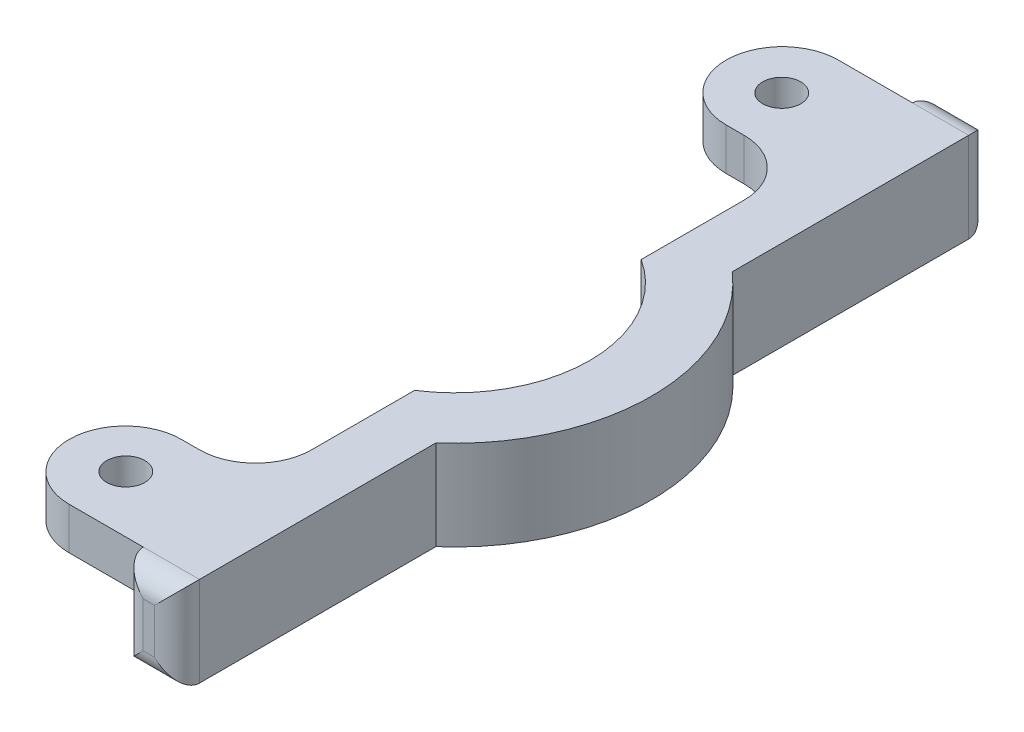
ISO-10303-21;
HEADER;
FILE_DESCRIPTION(('STEP AP214'),'2;1');
FILE_NAME('part.step','',(''),(''),'','','');
FILE_SCHEMA(('AUTOMOTIVE_DESIGN { 1 0 10303 214 1 1 1 1 }'));
ENDSEC;
DATA;
#1=APPLICATION_CONTEXT('core data for automotive mechanical design processes');
#2=APPLICATION_PROTOCOL_DEFINITION('international standard','automotive_design',2000,#1);
#3=PRODUCT_CONTEXT('',#1,'mechanical');
#4=PRODUCT('Part','Part','',(#3));
#5=PRODUCT_RELATED_PRODUCT_CATEGORY('part','',(#4));
#6=PRODUCT_DEFINITION_FORMATION('','',#4);
#7=PRODUCT_DEFINITION_CONTEXT('part definition',#1,'design');
#8=PRODUCT_DEFINITION('design','',#6,#7);
#9=PRODUCT_DEFINITION_SHAPE('','',#8);
#10=(LENGTH_UNIT() NAMED_UNIT(*) SI_UNIT(.MILLI.,.METRE.));
#11=(NAMED_UNIT(*) PLANE_ANGLE_UNIT() SI_UNIT($,.RADIAN.));
#12=(NAMED_UNIT(*) SI_UNIT($,.STERADIAN.) SOLID_ANGLE_UNIT());
#13=UNCERTAINTY_MEASURE_WITH_UNIT(LENGTH_MEASURE(1.E-05),#10,'distance_accuracy_value','');
#14=(GEOMETRIC_REPRESENTATION_CONTEXT(3) GLOBAL_UNCERTAINTY_ASSIGNED_CONTEXT((#13)) GLOBAL_UNIT_ASSIGNED_CONTEXT((#10,
#11,#12)) REPRESENTATION_CONTEXT('',''));
#15=CARTESIAN_POINT('',(0.,0.,0.));
#16=DIRECTION('',(0.,0.,1.));
#17=DIRECTION('',(1.,0.,0.));
#18=AXIS2_PLACEMENT_3D('',#15,#16,#17);
#19=CARTESIAN_POINT('',(8.255,0.,42.2389387108255));
#20=DIRECTION('',(1.,0.,0.));
#21=DIRECTION('',(0.,0.,-1.));
#22=AXIS2_PLACEMENT_3D('',#19,#20,#21);
#23=PLANE('',#22);
#24=DIRECTION('',(0.,0.,-1.));
#25=VECTOR('',#24,1.);
#26=CARTESIAN_POINT('',(8.255,5.08,42.2389387108255));
#27=LINE('',#26,#25);
#28=CARTESIAN_POINT('',(8.255,5.08,-12.8106430361633));
#29=VERTEX_POINT('',#28);
#30=CARTESIAN_POINT('',(8.255,5.08,-24.4450575477753));
#31=VERTEX_POINT('',#30);
#32=EDGE_CURVE('E283',#29,#31,#27,.T.);
#33=ORIENTED_EDGE('',*,*,#32,.T.);
#34=DIRECTION('',(0.,1.,0.));
#35=VECTOR('',#34,1.);
#36=CARTESIAN_POINT('',(8.255,0.3175,-24.4450575477753));
#37=LINE('',#36,#35);
#38=CARTESIAN_POINT('',(8.255,0.3175,-24.4450575477753));
#39=VERTEX_POINT('',#38);
#40=EDGE_CURVE('E356',#31,#39,#37,.F.);
#41=ORIENTED_EDGE('',*,*,#40,.T.);
#42=DIRECTION('',(0.,0.,1.));
#43=VECTOR('',#42,1.);
#44=CARTESIAN_POINT('',(8.255,0.3175,-43.4950575477753));
#45=LINE('',#44,#43);
#46=CARTESIAN_POINT('',(8.255,0.3175,-43.4950575477753));
#47=VERTEX_POINT('',#46);
#48=EDGE_CURVE('E248',#47,#39,#45,.T.);
#49=ORIENTED_EDGE('',*,*,#48,.F.);
#50=DIRECTION('',(0.,1.,0.));
#51=VECTOR('',#50,1.);
#52=CARTESIAN_POINT('',(8.255,-5.08,-43.4950575477753));
#53=LINE('',#52,#51);
#54=CARTESIAN_POINT('',(8.255,-5.08,-43.4950575477753));
#55=VERTEX_POINT('',#54);
#56=EDGE_CURVE('E328',#47,#55,#53,.F.);
#57=ORIENTED_EDGE('',*,*,#56,.T.);
#58=DIRECTION('',(0.,0.,-1.));
#59=VECTOR('',#58,1.);
#60=CARTESIAN_POINT('',(8.255,-5.08,0.));
#61=LINE('',#60,#59);
#62=CARTESIAN_POINT('',(8.255,-5.08,-12.8106430361633));
#63=VERTEX_POINT('',#62);
#64=EDGE_CURVE('E297',#63,#55,#61,.T.);
#65=ORIENTED_EDGE('',*,*,#64,.F.);
#66=DIRECTION('',(0.,-1.,0.));
#67=VECTOR('',#66,1.);
#68=CARTESIAN_POINT('',(8.255,5.08,-12.8106430361633));
#69=LINE('',#68,#67);
#70=EDGE_CURVE('E292',#63,#29,#69,.F.);
#71=ORIENTED_EDGE('',*,*,#70,.T.);
#72=EDGE_LOOP('',(#33,#41,#49,#57,#65,#71));
#73=FACE_BOUND('',#72,.T.);
#74=ADVANCED_FACE('F36',(#73),#23,.F.);
#75=CARTESIAN_POINT('',(0.,5.08,0.));
#76=DIRECTION('',(0.,-1.,0.));
#77=DIRECTION('',(0.,0.,-1.));
#78=AXIS2_PLACEMENT_3D('',#75,#76,#77);
#79=CYLINDRICAL_SURFACE('',#78,22.225);
#80=DIRECTION('',(0.,1.,0.));
#81=VECTOR('',#80,1.);
#82=CARTESIAN_POINT('',(14.605,0.,16.7524505670066));
#83=LINE('',#82,#81);
#84=CARTESIAN_POINT('',(14.605,-5.08,16.7524505670066));
#85=VERTEX_POINT('',#84);
#86=CARTESIAN_POINT('',(14.605,5.08,16.7524505670066));
#87=VERTEX_POINT('',#86);
#88=EDGE_CURVE('E274',#85,#87,#83,.T.);
#89=ORIENTED_EDGE('',*,*,#88,.F.);
#90=CARTESIAN_POINT('',(0.,-5.08,0.));
#91=DIRECTION('',(0.,1.,0.));
#92=DIRECTION('',(0.,0.,1.));
#93=AXIS2_PLACEMENT_3D('',#90,#91,#92);
#94=CIRCLE('',#93,22.225);
#95=CARTESIAN_POINT('',(14.605,-5.08,-16.7524505670066));
#96=VERTEX_POINT('',#95);
#97=EDGE_CURVE('E270',#85,#96,#94,.T.);
#98=ORIENTED_EDGE('',*,*,#97,.T.);
#99=DIRECTION('',(0.,1.,0.));
#100=VECTOR('',#99,1.);
#101=CARTESIAN_POINT('',(14.605,0.,-16.7524505670066));
#102=LINE('',#101,#100);
#103=CARTESIAN_POINT('',(14.605,5.08,-16.7524505670066));
#104=VERTEX_POINT('',#103);
#105=EDGE_CURVE('E280',#96,#104,#102,.T.);
#106=ORIENTED_EDGE('',*,*,#105,.T.);
#107=CARTESIAN_POINT('',(0.,5.08,0.));
#108=DIRECTION('',(0.,1.,0.));
#109=DIRECTION('',(0.,0.,1.));
#110=AXIS2_PLACEMENT_3D('',#107,#108,#109);
#111=CIRCLE('',#110,22.225);
#112=EDGE_CURVE('E290',#87,#104,#111,.T.);
#113=ORIENTED_EDGE('',*,*,#112,.F.);
#114=EDGE_LOOP('',(#89,#98,#106,#113));
#115=FACE_BOUND('',#114,.T.);
#116=ADVANCED_FACE('F426',(#115),#79,.T.);
#117=CARTESIAN_POINT('',(0.,5.08,0.));
#118=DIRECTION('',(0.,-1.,0.));
#119=DIRECTION('',(0.,0.,-1.));
#120=AXIS2_PLACEMENT_3D('',#117,#118,#119);
#121=CYLINDRICAL_SURFACE('',#120,15.24);
#122=ORIENTED_EDGE('',*,*,#70,.F.);
#123=CARTESIAN_POINT('',(0.,-5.08,0.));
#124=DIRECTION('',(0.,1.,0.));
#125=DIRECTION('',(0.,0.,1.));
#126=AXIS2_PLACEMENT_3D('',#123,#124,#125);
#127=CIRCLE('',#126,15.24);
#128=CARTESIAN_POINT('',(8.255,-5.08,12.8106430361633));
#129=VERTEX_POINT('',#128);
#130=EDGE_CURVE('E267',#129,#63,#127,.T.);
#131=ORIENTED_EDGE('',*,*,#130,.F.);
#132=DIRECTION('',(0.,-1.,0.));
#133=VECTOR('',#132,1.);
#134=CARTESIAN_POINT('',(8.255,5.08,12.8106430361633));
#135=LINE('',#134,#133);
#136=CARTESIAN_POINT('',(8.255,5.08,12.8106430361633));
#137=VERTEX_POINT('',#136);
#138=EDGE_CURVE('E294',#137,#129,#135,.T.);
#139=ORIENTED_EDGE('',*,*,#138,.F.);
#140=CARTESIAN_POINT('',(0.,5.08,0.));
#141=DIRECTION('',(0.,1.,0.));
#142=DIRECTION('',(0.,0.,1.));
#143=AXIS2_PLACEMENT_3D('',#140,#141,#142);
#144=CIRCLE('',#143,15.24);
#145=EDGE_CURVE('E287',#137,#29,#144,.T.);
#146=ORIENTED_EDGE('',*,*,#145,.T.);
#147=EDGE_LOOP('',(#122,#131,#139,#146));
#148=FACE_BOUND('',#147,.T.);
#149=ADVANCED_FACE('F433',(#148),#121,.F.);
#150=CARTESIAN_POINT('',(0.,-5.08,0.));
#151=DIRECTION('',(0.,-1.,0.));
#152=DIRECTION('',(0.,0.,1.));
#153=AXIS2_PLACEMENT_3D('',#150,#151,#152);
#154=PLANE('',#153);
#155=DIRECTION('',(0.,0.,1.));
#156=VECTOR('',#155,1.);
#157=CARTESIAN_POINT('',(14.605,-5.08,46.0350575477753));
#158=LINE('',#157,#156);
#159=CARTESIAN_POINT('',(14.605,-5.08,43.4950575477753));
#160=VERTEX_POINT('',#159);
#161=EDGE_CURVE('E261',#85,#160,#158,.T.);
#162=ORIENTED_EDGE('',*,*,#161,.T.);
#163=DIRECTION('',(-1.,0.,0.));
#164=VECTOR('',#163,1.);
#165=CARTESIAN_POINT('',(8.255,-5.08,43.4950575477753));
#166=LINE('',#165,#164);
#167=CARTESIAN_POINT('',(8.255,-5.08,43.4950575477753));
#168=VERTEX_POINT('',#167);
#169=EDGE_CURVE('E314',#160,#168,#166,.T.);
#170=ORIENTED_EDGE('',*,*,#169,.T.);
#171=EDGE_CURVE('E300',#168,#129,#61,.T.);
#172=ORIENTED_EDGE('',*,*,#171,.T.);
#173=ORIENTED_EDGE('',*,*,#130,.T.);
#174=ORIENTED_EDGE('',*,*,#64,.T.);
#175=DIRECTION('',(-1.,0.,0.));
#176=VECTOR('',#175,1.);
#177=CARTESIAN_POINT('',(0.,-5.08,-43.4950575477753));
#178=LINE('',#177,#176);
#179=CARTESIAN_POINT('',(14.605,-5.08,-43.4950575477753));
#180=VERTEX_POINT('',#179);
#181=EDGE_CURVE('E312',#55,#180,#178,.F.);
#182=ORIENTED_EDGE('',*,*,#181,.T.);
#183=DIRECTION('',(0.,0.,-1.));
#184=VECTOR('',#183,1.);
#185=CARTESIAN_POINT('',(14.605,-5.08,-46.0350575477753));
#186=LINE('',#185,#184);
#187=EDGE_CURVE('E264',#96,#180,#186,.T.);
#188=ORIENTED_EDGE('',*,*,#187,.F.);
#189=ORIENTED_EDGE('',*,*,#97,.F.);
#190=EDGE_LOOP('',(#162,#170,#172,#173,#174,#182,#188,#189));
#191=FACE_BOUND('',#190,.T.);
#192=ADVANCED_FACE('F448',(#191),#154,.T.);
#193=CARTESIAN_POINT('',(0.,5.08,0.));
#194=DIRECTION('',(0.,1.,0.));
#195=DIRECTION('',(0.,0.,1.));
#196=AXIS2_PLACEMENT_3D('',#193,#194,#195);
#197=PLANE('',#196);
#198=CARTESIAN_POINT('',(-0.127000000000002,5.08,37.084));
#199=DIRECTION('',(0.,-1.,0.));
#200=DIRECTION('',(0.,0.,-1.));
#201=AXIS2_PLACEMENT_3D('',#198,#199,#200);
#202=CIRCLE('',#201,2.15265);
#203=CARTESIAN_POINT('',(-0.127000000000002,5.08,34.93135));
#204=VERTEX_POINT('',#203);
#205=EDGE_CURVE('E234',#204,#204,#202,.T.);
#206=ORIENTED_EDGE('',*,*,#205,.T.);
#207=EDGE_LOOP('',(#206));
#208=FACE_BOUND('',#207,.T.);
#209=CARTESIAN_POINT('',(-0.127000000000002,5.08,-37.084));
#210=DIRECTION('',(0.,1.,0.));
#211=DIRECTION('',(0.,0.,1.));
#212=AXIS2_PLACEMENT_3D('',#209,#210,#211);
#213=CIRCLE('',#212,2.15265);
#214=CARTESIAN_POINT('',(-0.127000000000002,5.08,-34.93135));
#215=VERTEX_POINT('',#214);
#216=EDGE_CURVE('E244',#215,#215,#213,.T.);
#217=ORIENTED_EDGE('',*,*,#216,.F.);
#218=EDGE_LOOP('',(#217));
#219=FACE_BOUND('',#218,.T.);
#220=DIRECTION('',(1.,0.,0.));
#221=VECTOR('',#220,1.);
#222=CARTESIAN_POINT('',(-6.477,5.08,30.7950575477753));
#223=LINE('',#222,#221);
#224=CARTESIAN_POINT('',(-0.127,5.08,30.7950575477753));
#225=VERTEX_POINT('',#224);
#226=CARTESIAN_POINT('',(1.905,5.08,30.7950575477753));
#227=VERTEX_POINT('',#226);
#228=EDGE_CURVE('E202',#225,#227,#223,.T.);
#229=ORIENTED_EDGE('',*,*,#228,.F.);
#230=CARTESIAN_POINT('',(-0.127,5.08,37.1450575477753));
#231=DIRECTION('',(0.,1.,0.));
#232=DIRECTION('',(0.,0.,1.));
#233=AXIS2_PLACEMENT_3D('',#230,#231,#232);
#234=CIRCLE('',#233,6.35);
#235=CARTESIAN_POINT('',(-6.477,5.08,37.1450575477753));
#236=VERTEX_POINT('',#235);
#237=EDGE_CURVE('E384',#225,#236,#234,.T.);
#238=ORIENTED_EDGE('',*,*,#237,.T.);
#239=CARTESIAN_POINT('',(-0.127,5.08,37.1450575477753));
#240=DIRECTION('',(0.,1.,0.));
#241=DIRECTION('',(0.,0.,1.));
#242=AXIS2_PLACEMENT_3D('',#239,#240,#241);
#243=CIRCLE('',#242,6.35);
#244=CARTESIAN_POINT('',(-0.127,5.08,43.4950575477753));
#245=VERTEX_POINT('',#244);
#246=EDGE_CURVE('E199',#236,#245,#243,.T.);
#247=ORIENTED_EDGE('',*,*,#246,.T.);
#248=DIRECTION('',(1.,0.,0.));
#249=VECTOR('',#248,1.);
#250=CARTESIAN_POINT('',(-6.477,5.08,43.4950575477753));
#251=LINE('',#250,#249);
#252=CARTESIAN_POINT('',(8.255,5.08,43.4950575477753));
#253=VERTEX_POINT('',#252);
#254=EDGE_CURVE('E191',#245,#253,#251,.T.);
#255=ORIENTED_EDGE('',*,*,#254,.T.);
#256=DIRECTION('',(-1.,0.,0.));
#257=VECTOR('',#256,1.);
#258=CARTESIAN_POINT('',(14.605,5.08,43.4950575477753));
#259=LINE('',#258,#257);
#260=CARTESIAN_POINT('',(14.605,5.08,43.4950575477753));
#261=VERTEX_POINT('',#260);
#262=EDGE_CURVE('E196',#253,#261,#259,.F.);
#263=ORIENTED_EDGE('',*,*,#262,.T.);
#264=DIRECTION('',(0.,0.,1.));
#265=VECTOR('',#264,1.);
#266=CARTESIAN_POINT('',(14.605,5.08,46.0350575477753));
#267=LINE('',#266,#265);
#268=EDGE_CURVE('E272',#87,#261,#267,.T.);
#269=ORIENTED_EDGE('',*,*,#268,.F.);
#270=ORIENTED_EDGE('',*,*,#112,.T.);
#271=DIRECTION('',(0.,0.,-1.));
#272=VECTOR('',#271,1.);
#273=CARTESIAN_POINT('',(14.605,5.08,-46.0350575477753));
#274=LINE('',#273,#272);
#275=CARTESIAN_POINT('',(14.605,5.08,-43.4950575477753));
#276=VERTEX_POINT('',#275);
#277=EDGE_CURVE('E277',#104,#276,#274,.T.);
#278=ORIENTED_EDGE('',*,*,#277,.T.);
#279=DIRECTION('',(-1.,0.,0.));
#280=VECTOR('',#279,1.);
#281=CARTESIAN_POINT('',(0.,5.08,-43.4950575477753));
#282=LINE('',#281,#280);
#283=CARTESIAN_POINT('',(8.255,5.08,-43.4950575477753));
#284=VERTEX_POINT('',#283);
#285=EDGE_CURVE('E213',#276,#284,#282,.T.);
#286=ORIENTED_EDGE('',*,*,#285,.T.);
#287=DIRECTION('',(1.,0.,0.));
#288=VECTOR('',#287,1.);
#289=CARTESIAN_POINT('',(-6.477,5.08,-43.4950575477753));
#290=LINE('',#289,#288);
#291=CARTESIAN_POINT('',(-0.127,5.08,-43.4950575477753));
#292=VERTEX_POINT('',#291);
#293=EDGE_CURVE('E250',#292,#284,#290,.T.);
#294=ORIENTED_EDGE('',*,*,#293,.F.);
#295=CARTESIAN_POINT('',(-0.127,5.08,-37.1450575477753));
#296=DIRECTION('',(0.,1.,0.));
#297=DIRECTION('',(0.,0.,1.));
#298=AXIS2_PLACEMENT_3D('',#295,#296,#297);
#299=CIRCLE('',#298,6.35);
#300=CARTESIAN_POINT('',(-6.477,5.08,-37.1450575477753));
#301=VERTEX_POINT('',#300);
#302=EDGE_CURVE('E359',#292,#301,#299,.T.);
#303=ORIENTED_EDGE('',*,*,#302,.T.);
#304=CARTESIAN_POINT('',(-0.127,5.08,-37.1450575477753));
#305=DIRECTION('',(0.,1.,0.));
#306=DIRECTION('',(0.,0.,1.));
#307=AXIS2_PLACEMENT_3D('',#304,#305,#306);
#308=CIRCLE('',#307,6.35);
#309=CARTESIAN_POINT('',(-0.127,5.08,-30.7950575477753));
#310=VERTEX_POINT('',#309);
#311=EDGE_CURVE('E361',#301,#310,#308,.T.);
#312=ORIENTED_EDGE('',*,*,#311,.T.);
#313=DIRECTION('',(1.,0.,0.));
#314=VECTOR('',#313,1.);
#315=CARTESIAN_POINT('',(-6.477,5.08,-30.7950575477753));
#316=LINE('',#315,#314);
#317=CARTESIAN_POINT('',(1.905,5.08,-30.7950575477753));
#318=VERTEX_POINT('',#317);
#319=EDGE_CURVE('E252',#310,#318,#316,.T.);
#320=ORIENTED_EDGE('',*,*,#319,.T.);
#321=CARTESIAN_POINT('',(1.905,5.08,-24.4450575477753));
#322=DIRECTION('',(0.,1.,0.));
#323=DIRECTION('',(0.,0.,1.));
#324=AXIS2_PLACEMENT_3D('',#321,#322,#323);
#325=CIRCLE('',#324,6.35);
#326=EDGE_CURVE('E369',#318,#31,#325,.F.);
#327=ORIENTED_EDGE('',*,*,#326,.T.);
#328=ORIENTED_EDGE('',*,*,#32,.F.);
#329=ORIENTED_EDGE('',*,*,#145,.F.);
#330=CARTESIAN_POINT('',(8.255,5.08,24.4450575477753));
#331=VERTEX_POINT('',#330);
#332=EDGE_CURVE('E286',#331,#137,#27,.T.);
#333=ORIENTED_EDGE('',*,*,#332,.F.);
#334=CARTESIAN_POINT('',(1.905,5.08,24.4450575477753));
#335=DIRECTION('',(0.,1.,0.));
#336=DIRECTION('',(0.,0.,1.));
#337=AXIS2_PLACEMENT_3D('',#334,#335,#336);
#338=CIRCLE('',#337,6.35);
#339=EDGE_CURVE('E45',#331,#227,#338,.F.);
#340=ORIENTED_EDGE('',*,*,#339,.T.);
#341=EDGE_LOOP('',(#229,#238,#247,#255,#263,#269,#270,#278,#286,#294,#303,#312,#320,#327,#328,
#329,#333,#340));
#342=FACE_BOUND('',#341,.T.);
#343=ADVANCED_FACE('F194',(#208,#219,#342),#197,.T.);
#344=DIRECTION('',(0.,0.,-1.));
#345=VECTOR('',#344,1.);
#346=CARTESIAN_POINT('',(8.255,0.3175,43.4950575477753));
#347=LINE('',#346,#345);
#348=CARTESIAN_POINT('',(8.255,0.3175,43.4950575477753));
#349=VERTEX_POINT('',#348);
#350=CARTESIAN_POINT('',(8.255,0.3175,24.4450575477753));
#351=VERTEX_POINT('',#350);
#352=EDGE_CURVE('E229',#349,#351,#347,.T.);
#353=ORIENTED_EDGE('',*,*,#352,.T.);
#354=DIRECTION('',(0.,1.,0.));
#355=VECTOR('',#354,1.);
#356=CARTESIAN_POINT('',(8.255,0.,24.4450575477753));
#357=LINE('',#356,#355);
#358=EDGE_CURVE('E373',#351,#331,#357,.T.);
#359=ORIENTED_EDGE('',*,*,#358,.T.);
#360=ORIENTED_EDGE('',*,*,#332,.T.);
#361=ORIENTED_EDGE('',*,*,#138,.T.);
#362=ORIENTED_EDGE('',*,*,#171,.F.);
#363=DIRECTION('',(0.,1.,0.));
#364=VECTOR('',#363,1.);
#365=CARTESIAN_POINT('',(8.255,0.,43.4950575477753));
#366=LINE('',#365,#364);
#367=EDGE_CURVE('E316',#168,#349,#366,.T.);
#368=ORIENTED_EDGE('',*,*,#367,.T.);
#369=EDGE_LOOP('',(#353,#359,#360,#361,#362,#368));
#370=FACE_BOUND('',#369,.T.);
#371=ADVANCED_FACE('F429',(#370),#23,.F.);
#372=CARTESIAN_POINT('',(8.255,0.,-46.0350575477753));
#373=DIRECTION('',(0.,0.,-1.));
#374=DIRECTION('',(-1.,0.,0.));
#375=AXIS2_PLACEMENT_3D('',#372,#373,#374);
#376=PLANE('',#375);
#377=DIRECTION('',(-1.,0.,0.));
#378=VECTOR('',#377,1.);
#379=CARTESIAN_POINT('',(8.255,-2.54,-46.0350575477753));
#380=LINE('',#379,#378);
#381=CARTESIAN_POINT('',(12.065,-2.54,-46.0350575477753));
#382=VERTEX_POINT('',#381);
#383=CARTESIAN_POINT('',(10.795,-2.54,-46.0350575477753));
#384=VERTEX_POINT('',#383);
#385=EDGE_CURVE('E323',#382,#384,#380,.T.);
#386=ORIENTED_EDGE('',*,*,#385,.T.);
#387=DIRECTION('',(0.,1.,0.));
#388=VECTOR('',#387,1.);
#389=CARTESIAN_POINT('',(10.795,5.08,-46.0350575477753));
#390=LINE('',#389,#388);
#391=CARTESIAN_POINT('',(10.795,2.54,-46.0350575477753));
#392=VERTEX_POINT('',#391);
#393=EDGE_CURVE('E325',#384,#392,#390,.T.);
#394=ORIENTED_EDGE('',*,*,#393,.T.);
#395=DIRECTION('',(-1.,0.,0.));
#396=VECTOR('',#395,1.);
#397=CARTESIAN_POINT('',(8.255,2.54,-46.0350575477753));
#398=LINE('',#397,#396);
#399=CARTESIAN_POINT('',(12.065,2.54,-46.0350575477753));
#400=VERTEX_POINT('',#399);
#401=EDGE_CURVE('E212',#392,#400,#398,.F.);
#402=ORIENTED_EDGE('',*,*,#401,.T.);
#403=DIRECTION('',(0.,1.,0.));
#404=VECTOR('',#403,1.);
#405=CARTESIAN_POINT('',(12.065,0.,-46.0350575477753));
#406=LINE('',#405,#404);
#407=EDGE_CURVE('E321',#400,#382,#406,.F.);
#408=ORIENTED_EDGE('',*,*,#407,.T.);
#409=EDGE_LOOP('',(#386,#394,#402,#408));
#410=FACE_BOUND('',#409,.T.);
#411=ADVANCED_FACE('F439',(#410),#376,.T.);
#412=CARTESIAN_POINT('',(14.605,0.,-46.0350575477753));
#413=DIRECTION('',(1.,0.,0.));
#414=DIRECTION('',(0.,0.,-1.));
#415=AXIS2_PLACEMENT_3D('',#412,#413,#414);
#416=PLANE('',#415);
#417=ORIENTED_EDGE('',*,*,#187,.T.);
#418=DIRECTION('',(0.,1.,0.));
#419=VECTOR('',#418,1.);
#420=CARTESIAN_POINT('',(14.605,0.,-43.4950575477753));
#421=LINE('',#420,#419);
#422=EDGE_CURVE('E332',#180,#276,#421,.T.);
#423=ORIENTED_EDGE('',*,*,#422,.T.);
#424=ORIENTED_EDGE('',*,*,#277,.F.);
#425=ORIENTED_EDGE('',*,*,#105,.F.);
#426=EDGE_LOOP('',(#417,#423,#424,#425));
#427=FACE_BOUND('',#426,.T.);
#428=ADVANCED_FACE('F445',(#427),#416,.T.);
#429=CARTESIAN_POINT('',(14.605,0.,46.0350575477753));
#430=DIRECTION('',(-1.,0.,0.));
#431=DIRECTION('',(0.,0.,1.));
#432=AXIS2_PLACEMENT_3D('',#429,#430,#431);
#433=PLANE('',#432);
#434=ORIENTED_EDGE('',*,*,#268,.T.);
#435=DIRECTION('',(0.,1.,0.));
#436=VECTOR('',#435,1.);
#437=CARTESIAN_POINT('',(14.605,0.,43.4950575477753));
#438=LINE('',#437,#436);
#439=EDGE_CURVE('E309',#261,#160,#438,.F.);
#440=ORIENTED_EDGE('',*,*,#439,.T.);
#441=ORIENTED_EDGE('',*,*,#161,.F.);
#442=ORIENTED_EDGE('',*,*,#88,.T.);
#443=EDGE_LOOP('',(#434,#440,#441,#442));
#444=FACE_BOUND('',#443,.T.);
#445=ADVANCED_FACE('F464',(#444),#433,.F.);
#446=CARTESIAN_POINT('',(8.255,0.,46.0350575477753));
#447=DIRECTION('',(0.,0.,-1.));
#448=DIRECTION('',(-1.,0.,0.));
#449=AXIS2_PLACEMENT_3D('',#446,#447,#448);
#450=PLANE('',#449);
#451=DIRECTION('',(-1.,0.,0.));
#452=VECTOR('',#451,1.);
#453=CARTESIAN_POINT('',(14.605,-2.54,46.0350575477753));
#454=LINE('',#453,#452);
#455=CARTESIAN_POINT('',(10.795,-2.54,46.0350575477753));
#456=VERTEX_POINT('',#455);
#457=CARTESIAN_POINT('',(12.065,-2.54,46.0350575477753));
#458=VERTEX_POINT('',#457);
#459=EDGE_CURVE('E304',#456,#458,#454,.F.);
#460=ORIENTED_EDGE('',*,*,#459,.T.);
#461=DIRECTION('',(0.,1.,0.));
#462=VECTOR('',#461,1.);
#463=CARTESIAN_POINT('',(12.065,0.,46.0350575477753));
#464=LINE('',#463,#462);
#465=CARTESIAN_POINT('',(12.065,2.54,46.0350575477753));
#466=VERTEX_POINT('',#465);
#467=EDGE_CURVE('E306',#458,#466,#464,.T.);
#468=ORIENTED_EDGE('',*,*,#467,.T.);
#469=DIRECTION('',(-1.,0.,0.));
#470=VECTOR('',#469,1.);
#471=CARTESIAN_POINT('',(8.255,2.54,46.0350575477753));
#472=LINE('',#471,#470);
#473=CARTESIAN_POINT('',(10.795,2.54,46.0350575477753));
#474=VERTEX_POINT('',#473);
#475=EDGE_CURVE('E301',#466,#474,#472,.T.);
#476=ORIENTED_EDGE('',*,*,#475,.T.);
#477=DIRECTION('',(0.,1.,0.));
#478=VECTOR('',#477,1.);
#479=CARTESIAN_POINT('',(10.795,0.,46.0350575477753));
#480=LINE('',#479,#478);
#481=EDGE_CURVE('E223',#474,#456,#480,.F.);
#482=ORIENTED_EDGE('',*,*,#481,.T.);
#483=EDGE_LOOP('',(#460,#468,#476,#482));
#484=FACE_BOUND('',#483,.T.);
#485=ADVANCED_FACE('F458',(#484),#450,.F.);
#486=CARTESIAN_POINT('',(10.795,0.,43.4950575477753));
#487=DIRECTION('',(0.,1.,0.));
#488=DIRECTION('',(0.,0.,1.));
#489=AXIS2_PLACEMENT_3D('',#486,#487,#488);
#490=CYLINDRICAL_SURFACE('',#489,2.54);
#491=CARTESIAN_POINT('',(10.795,2.54,43.4950575477753));
#492=DIRECTION('',(0.707106781186547,0.707106781186547,0.));
#493=DIRECTION('',(0.707106781186547,-0.707106781186547,0.));
#494=AXIS2_PLACEMENT_3D('',#491,#492,#493);
#495=ELLIPSE('',#494,3.59210244842766,2.54);
#496=EDGE_CURVE('E210',#253,#474,#495,.T.);
#497=ORIENTED_EDGE('',*,*,#496,.F.);
#498=DIRECTION('',(0.,-1.,0.));
#499=VECTOR('',#498,1.);
#500=CARTESIAN_POINT('',(8.255,5.08,43.4950575477753));
#501=LINE('',#500,#499);
#502=EDGE_CURVE('E220',#253,#349,#501,.T.);
#503=ORIENTED_EDGE('',*,*,#502,.T.);
#504=ORIENTED_EDGE('',*,*,#367,.F.);
#505=CARTESIAN_POINT('',(10.795,-2.54,43.4950575477753));
#506=DIRECTION('',(-0.707106781186547,0.707106781186547,0.));
#507=DIRECTION('',(0.707106781186547,0.707106781186547,0.));
#508=AXIS2_PLACEMENT_3D('',#505,#506,#507);
#509=ELLIPSE('',#508,3.59210244842766,2.54);
#510=EDGE_CURVE('E224',#456,#168,#509,.F.);
#511=ORIENTED_EDGE('',*,*,#510,.F.);
#512=ORIENTED_EDGE('',*,*,#481,.F.);
#513=EDGE_LOOP('',(#497,#503,#504,#511,#512));
#514=FACE_BOUND('',#513,.T.);
#515=ADVANCED_FACE('F218',(#514),#490,.T.);
#516=CARTESIAN_POINT('',(0.,-2.54,43.4950575477753));
#517=DIRECTION('',(1.,0.,0.));
#518=DIRECTION('',(0.,0.,-1.));
#519=AXIS2_PLACEMENT_3D('',#516,#517,#518);
#520=CYLINDRICAL_SURFACE('',#519,2.54);
#521=ORIENTED_EDGE('',*,*,#510,.T.);
#522=ORIENTED_EDGE('',*,*,#169,.F.);
#523=CARTESIAN_POINT('',(12.065,-2.54,43.4950575477753));
#524=DIRECTION('',(0.707106781186547,0.707106781186547,0.));
#525=DIRECTION('',(0.707106781186547,-0.707106781186547,0.));
#526=AXIS2_PLACEMENT_3D('',#523,#524,#525);
#527=ELLIPSE('',#526,3.59210244842766,2.54);
#528=EDGE_CURVE('E225',#458,#160,#527,.T.);
#529=ORIENTED_EDGE('',*,*,#528,.F.);
#530=ORIENTED_EDGE('',*,*,#459,.F.);
#531=EDGE_LOOP('',(#521,#522,#529,#530));
#532=FACE_BOUND('',#531,.T.);
#533=ADVANCED_FACE('F454',(#532),#520,.T.);
#534=CARTESIAN_POINT('',(8.255,2.54,43.4950575477753));
#535=DIRECTION('',(1.,0.,0.));
#536=DIRECTION('',(0.,0.,-1.));
#537=AXIS2_PLACEMENT_3D('',#534,#535,#536);
#538=CYLINDRICAL_SURFACE('',#537,2.54);
#539=ORIENTED_EDGE('',*,*,#496,.T.);
#540=ORIENTED_EDGE('',*,*,#475,.F.);
#541=CARTESIAN_POINT('',(12.065,2.54,43.4950575477753));
#542=DIRECTION('',(0.707106781186547,-0.707106781186547,0.));
#543=DIRECTION('',(0.707106781186547,0.707106781186547,0.));
#544=AXIS2_PLACEMENT_3D('',#541,#542,#543);
#545=ELLIPSE('',#544,3.59210244842766,2.54);
#546=EDGE_CURVE('E211',#261,#466,#545,.T.);
#547=ORIENTED_EDGE('',*,*,#546,.F.);
#548=ORIENTED_EDGE('',*,*,#262,.F.);
#549=EDGE_LOOP('',(#539,#540,#547,#548));
#550=FACE_BOUND('',#549,.T.);
#551=ADVANCED_FACE('F208',(#550),#538,.T.);
#552=CARTESIAN_POINT('',(12.065,0.,43.4950575477753));
#553=DIRECTION('',(0.,1.,0.));
#554=DIRECTION('',(0.,0.,1.));
#555=AXIS2_PLACEMENT_3D('',#552,#553,#554);
#556=CYLINDRICAL_SURFACE('',#555,2.54);
#557=ORIENTED_EDGE('',*,*,#528,.T.);
#558=ORIENTED_EDGE('',*,*,#439,.F.);
#559=ORIENTED_EDGE('',*,*,#546,.T.);
#560=ORIENTED_EDGE('',*,*,#467,.F.);
#561=EDGE_LOOP('',(#557,#558,#559,#560));
#562=FACE_BOUND('',#561,.T.);
#563=ADVANCED_FACE('F460',(#562),#556,.T.);
#564=CARTESIAN_POINT('',(12.065,0.,-43.4950575477753));
#565=DIRECTION('',(0.,1.,0.));
#566=DIRECTION('',(0.,0.,1.));
#567=AXIS2_PLACEMENT_3D('',#564,#565,#566);
#568=CYLINDRICAL_SURFACE('',#567,2.54);
#569=CARTESIAN_POINT('',(12.065,2.54,-43.4950575477753));
#570=DIRECTION('',(-0.707106781186547,0.707106781186547,0.));
#571=DIRECTION('',(-0.707106781186547,-0.707106781186547,0.));
#572=AXIS2_PLACEMENT_3D('',#569,#570,#571);
#573=ELLIPSE('',#572,3.59210244842766,2.54);
#574=EDGE_CURVE('E344',#276,#400,#573,.T.);
#575=ORIENTED_EDGE('',*,*,#574,.F.);
#576=ORIENTED_EDGE('',*,*,#422,.F.);
#577=CARTESIAN_POINT('',(12.065,-2.54,-43.4950575477753));
#578=DIRECTION('',(0.707106781186547,0.707106781186547,0.));
#579=DIRECTION('',(-0.707106781186547,0.707106781186547,0.));
#580=AXIS2_PLACEMENT_3D('',#577,#578,#579);
#581=ELLIPSE('',#580,3.59210244842766,2.54);
#582=EDGE_CURVE('E336',#382,#180,#581,.F.);
#583=ORIENTED_EDGE('',*,*,#582,.F.);
#584=ORIENTED_EDGE('',*,*,#407,.F.);
#585=EDGE_LOOP('',(#575,#576,#583,#584));
#586=FACE_BOUND('',#585,.T.);
#587=ADVANCED_FACE('F478',(#586),#568,.T.);
#588=CARTESIAN_POINT('',(8.255,-2.54,-43.4950575477753));
#589=DIRECTION('',(-1.,0.,0.));
#590=DIRECTION('',(0.,0.,1.));
#591=AXIS2_PLACEMENT_3D('',#588,#589,#590);
#592=CYLINDRICAL_SURFACE('',#591,2.54);
#593=ORIENTED_EDGE('',*,*,#582,.T.);
#594=ORIENTED_EDGE('',*,*,#181,.F.);
#595=CARTESIAN_POINT('',(10.795,-2.54,-43.4950575477753));
#596=DIRECTION('',(-0.707106781186547,0.707106781186547,0.));
#597=DIRECTION('',(-0.707106781186547,-0.707106781186547,0.));
#598=AXIS2_PLACEMENT_3D('',#595,#596,#597);
#599=ELLIPSE('',#598,3.59210244842766,2.54);
#600=EDGE_CURVE('E341',#384,#55,#599,.T.);
#601=ORIENTED_EDGE('',*,*,#600,.F.);
#602=ORIENTED_EDGE('',*,*,#385,.F.);
#603=EDGE_LOOP('',(#593,#594,#601,#602));
#604=FACE_BOUND('',#603,.T.);
#605=ADVANCED_FACE('F519',(#604),#592,.T.);
#606=CARTESIAN_POINT('',(0.,2.54,-43.4950575477753));
#607=DIRECTION('',(-1.,0.,0.));
#608=DIRECTION('',(0.,0.,1.));
#609=AXIS2_PLACEMENT_3D('',#606,#607,#608);
#610=CYLINDRICAL_SURFACE('',#609,2.54);
#611=ORIENTED_EDGE('',*,*,#574,.T.);
#612=ORIENTED_EDGE('',*,*,#401,.F.);
#613=CARTESIAN_POINT('',(10.795,2.54,-43.4950575477753));
#614=DIRECTION('',(-0.707106781186547,-0.707106781186547,0.));
#615=DIRECTION('',(-0.707106781186547,0.707106781186547,0.));
#616=AXIS2_PLACEMENT_3D('',#613,#614,#615);
#617=ELLIPSE('',#616,3.59210244842766,2.54);
#618=EDGE_CURVE('E260',#284,#392,#617,.T.);
#619=ORIENTED_EDGE('',*,*,#618,.F.);
#620=ORIENTED_EDGE('',*,*,#285,.F.);
#621=EDGE_LOOP('',(#611,#612,#619,#620));
#622=FACE_BOUND('',#621,.T.);
#623=ADVANCED_FACE('F483',(#622),#610,.T.);
#624=CARTESIAN_POINT('',(10.795,0.,-43.4950575477753));
#625=DIRECTION('',(0.,-1.,0.));
#626=DIRECTION('',(0.,0.,-1.));
#627=AXIS2_PLACEMENT_3D('',#624,#625,#626);
#628=CYLINDRICAL_SURFACE('',#627,2.54);
#629=ORIENTED_EDGE('',*,*,#600,.T.);
#630=ORIENTED_EDGE('',*,*,#56,.F.);
#631=EDGE_CURVE('E329',#284,#47,#53,.F.);
#632=ORIENTED_EDGE('',*,*,#631,.F.);
#633=ORIENTED_EDGE('',*,*,#618,.T.);
#634=ORIENTED_EDGE('',*,*,#393,.F.);
#635=EDGE_LOOP('',(#629,#630,#632,#633,#634));
#636=FACE_BOUND('',#635,.T.);
#637=ADVANCED_FACE('F486',(#636),#628,.T.);
#638=CARTESIAN_POINT('',(-6.477,5.08,-43.4950575477753));
#639=DIRECTION('',(0.,0.,1.));
#640=DIRECTION('',(1.,0.,0.));
#641=AXIS2_PLACEMENT_3D('',#638,#639,#640);
#642=PLANE('',#641);
#643=DIRECTION('',(1.,0.,0.));
#644=VECTOR('',#643,1.);
#645=CARTESIAN_POINT('',(-6.477,0.3175,-43.4950575477753));
#646=LINE('',#645,#644);
#647=CARTESIAN_POINT('',(-0.127,0.3175,-43.4950575477753));
#648=VERTEX_POINT('',#647);
#649=EDGE_CURVE('E258',#648,#47,#646,.T.);
#650=ORIENTED_EDGE('',*,*,#649,.F.);
#651=DIRECTION('',(0.,-1.,0.));
#652=VECTOR('',#651,1.);
#653=CARTESIAN_POINT('',(-0.127,5.08,-43.4950575477753));
#654=LINE('',#653,#652);
#655=EDGE_CURVE('E367',#648,#292,#654,.F.);
#656=ORIENTED_EDGE('',*,*,#655,.T.);
#657=ORIENTED_EDGE('',*,*,#293,.T.);
#658=ORIENTED_EDGE('',*,*,#631,.T.);
#659=EDGE_LOOP('',(#650,#656,#657,#658));
#660=FACE_BOUND('',#659,.T.);
#661=ADVANCED_FACE('F491',(#660),#642,.F.);
#662=CARTESIAN_POINT('',(-6.477,0.3175,-43.4950575477753));
#663=DIRECTION('',(0.,1.,0.));
#664=DIRECTION('',(0.,0.,1.));
#665=AXIS2_PLACEMENT_3D('',#662,#663,#664);
#666=PLANE('',#665);
#667=CARTESIAN_POINT('',(-0.127000000000002,0.317500000000001,-37.084));
#668=DIRECTION('',(0.,1.,0.));
#669=DIRECTION('',(0.,0.,1.));
#670=AXIS2_PLACEMENT_3D('',#667,#668,#669);
#671=CIRCLE('',#670,2.15265);
#672=CARTESIAN_POINT('',(-0.127000000000002,0.317500000000001,-34.93135));
#673=VERTEX_POINT('',#672);
#674=EDGE_CURVE('E247',#673,#673,#671,.T.);
#675=ORIENTED_EDGE('',*,*,#674,.T.);
#676=EDGE_LOOP('',(#675));
#677=FACE_BOUND('',#676,.T.);
#678=DIRECTION('',(1.,0.,0.));
#679=VECTOR('',#678,1.);
#680=CARTESIAN_POINT('',(-6.477,0.3175,-30.7950575477753));
#681=LINE('',#680,#679);
#682=CARTESIAN_POINT('',(-0.127,0.3175,-30.7950575477753));
#683=VERTEX_POINT('',#682);
#684=CARTESIAN_POINT('',(1.905,0.3175,-30.7950575477753));
#685=VERTEX_POINT('',#684);
#686=EDGE_CURVE('E255',#683,#685,#681,.T.);
#687=ORIENTED_EDGE('',*,*,#686,.F.);
#688=CARTESIAN_POINT('',(-0.127,0.3175,-37.1450575477753));
#689=DIRECTION('',(0.,1.,0.));
#690=DIRECTION('',(0.,0.,1.));
#691=AXIS2_PLACEMENT_3D('',#688,#689,#690);
#692=CIRCLE('',#691,6.35);
#693=CARTESIAN_POINT('',(-6.477,0.3175,-37.1450575477753));
#694=VERTEX_POINT('',#693);
#695=EDGE_CURVE('E365',#683,#694,#692,.F.);
#696=ORIENTED_EDGE('',*,*,#695,.T.);
#697=CARTESIAN_POINT('',(-0.127,0.3175,-37.1450575477753));
#698=DIRECTION('',(0.,1.,0.));
#699=DIRECTION('',(0.,0.,1.));
#700=AXIS2_PLACEMENT_3D('',#697,#698,#699);
#701=CIRCLE('',#700,6.35);
#702=EDGE_CURVE('E363',#694,#648,#701,.F.);
#703=ORIENTED_EDGE('',*,*,#702,.T.);
#704=ORIENTED_EDGE('',*,*,#649,.T.);
#705=ORIENTED_EDGE('',*,*,#48,.T.);
#706=CARTESIAN_POINT('',(1.905,0.3175,-24.4450575477753));
#707=DIRECTION('',(0.,1.,0.));
#708=DIRECTION('',(0.,0.,1.));
#709=AXIS2_PLACEMENT_3D('',#706,#707,#708);
#710=CIRCLE('',#709,6.35);
#711=EDGE_CURVE('E371',#39,#685,#710,.T.);
#712=ORIENTED_EDGE('',*,*,#711,.T.);
#713=EDGE_LOOP('',(#687,#696,#703,#704,#705,#712));
#714=FACE_BOUND('',#713,.T.);
#715=ADVANCED_FACE('F629',(#677,#714),#666,.F.);
#716=CARTESIAN_POINT('',(-6.477,5.08,-30.7950575477753));
#717=DIRECTION('',(0.,0.,-1.));
#718=DIRECTION('',(-1.,0.,0.));
#719=AXIS2_PLACEMENT_3D('',#716,#717,#718);
#720=PLANE('',#719);
#721=ORIENTED_EDGE('',*,*,#686,.T.);
#722=DIRECTION('',(0.,1.,0.));
#723=VECTOR('',#722,1.);
#724=CARTESIAN_POINT('',(1.905,5.08,-30.7950575477753));
#725=LINE('',#724,#723);
#726=EDGE_CURVE('E353',#685,#318,#725,.T.);
#727=ORIENTED_EDGE('',*,*,#726,.T.);
#728=ORIENTED_EDGE('',*,*,#319,.F.);
#729=DIRECTION('',(0.,1.,0.));
#730=VECTOR('',#729,1.);
#731=CARTESIAN_POINT('',(-0.127,0.3175,-30.7950575477753));
#732=LINE('',#731,#730);
#733=EDGE_CURVE('E334',#310,#683,#732,.F.);
#734=ORIENTED_EDGE('',*,*,#733,.T.);
#735=EDGE_LOOP('',(#721,#727,#728,#734));
#736=FACE_BOUND('',#735,.T.);
#737=ADVANCED_FACE('F504',(#736),#720,.F.);
#738=CARTESIAN_POINT('',(-0.127000000000002,-7.62,-37.084));
#739=DIRECTION('',(0.,1.,0.));
#740=DIRECTION('',(0.,0.,1.));
#741=AXIS2_PLACEMENT_3D('',#738,#739,#740);
#742=CYLINDRICAL_SURFACE('',#741,2.15265);
#743=ORIENTED_EDGE('',*,*,#216,.T.);
#744=EDGE_LOOP('',(#743));
#745=FACE_BOUND('',#744,.T.);
#746=ORIENTED_EDGE('',*,*,#674,.F.);
#747=EDGE_LOOP('',(#746));
#748=FACE_BOUND('',#747,.T.);
#749=ADVANCED_FACE('F533',(#745,#748),#742,.F.);
#750=CARTESIAN_POINT('',(1.905,5.08,-24.4450575477753));
#751=DIRECTION('',(0.,-1.,0.));
#752=DIRECTION('',(0.,0.,-1.));
#753=AXIS2_PLACEMENT_3D('',#750,#751,#752);
#754=CYLINDRICAL_SURFACE('',#753,6.35);
#755=ORIENTED_EDGE('',*,*,#711,.F.);
#756=ORIENTED_EDGE('',*,*,#40,.F.);
#757=ORIENTED_EDGE('',*,*,#326,.F.);
#758=ORIENTED_EDGE('',*,*,#726,.F.);
#759=EDGE_LOOP('',(#755,#756,#757,#758));
#760=FACE_BOUND('',#759,.T.);
#761=ADVANCED_FACE('F509',(#760),#754,.F.);
#762=CARTESIAN_POINT('',(-0.127,0.,-37.1450575477753));
#763=DIRECTION('',(0.,1.,0.));
#764=DIRECTION('',(0.,0.,1.));
#765=AXIS2_PLACEMENT_3D('',#762,#763,#764);
#766=CYLINDRICAL_SURFACE('',#765,6.35);
#767=ORIENTED_EDGE('',*,*,#655,.F.);
#768=ORIENTED_EDGE('',*,*,#702,.F.);
#769=DIRECTION('',(0.,-1.,0.));
#770=VECTOR('',#769,1.);
#771=CARTESIAN_POINT('',(-6.477,0.3175,-37.1450575477753));
#772=LINE('',#771,#770);
#773=EDGE_CURVE('E201',#301,#694,#772,.T.);
#774=ORIENTED_EDGE('',*,*,#773,.F.);
#775=ORIENTED_EDGE('',*,*,#302,.F.);
#776=EDGE_LOOP('',(#767,#768,#774,#775));
#777=FACE_BOUND('',#776,.T.);
#778=ADVANCED_FACE('F496',(#777),#766,.T.);
#779=CARTESIAN_POINT('',(-0.127,0.,-37.1450575477753));
#780=DIRECTION('',(0.,-1.,0.));
#781=DIRECTION('',(0.,0.,-1.));
#782=AXIS2_PLACEMENT_3D('',#779,#780,#781);
#783=CYLINDRICAL_SURFACE('',#782,6.35);
#784=ORIENTED_EDGE('',*,*,#695,.F.);
#785=ORIENTED_EDGE('',*,*,#733,.F.);
#786=ORIENTED_EDGE('',*,*,#311,.F.);
#787=ORIENTED_EDGE('',*,*,#773,.T.);
#788=EDGE_LOOP('',(#784,#785,#786,#787));
#789=FACE_BOUND('',#788,.T.);
#790=ADVANCED_FACE('F501',(#789),#783,.T.);
#791=CARTESIAN_POINT('',(-6.477,5.08,43.4950575477753));
#792=DIRECTION('',(0.,0.,1.));
#793=DIRECTION('',(1.,0.,0.));
#794=AXIS2_PLACEMENT_3D('',#791,#792,#793);
#795=PLANE('',#794);
#796=ORIENTED_EDGE('',*,*,#254,.F.);
#797=DIRECTION('',(0.,-1.,0.));
#798=VECTOR('',#797,1.);
#799=CARTESIAN_POINT('',(-0.127,5.08,43.4950575477753));
#800=LINE('',#799,#798);
#801=CARTESIAN_POINT('',(-0.127,0.3175,43.4950575477753));
#802=VERTEX_POINT('',#801);
#803=EDGE_CURVE('E60',#245,#802,#800,.T.);
#804=ORIENTED_EDGE('',*,*,#803,.T.);
#805=DIRECTION('',(1.,0.,0.));
#806=VECTOR('',#805,1.);
#807=CARTESIAN_POINT('',(-6.477,0.3175,43.4950575477753));
#808=LINE('',#807,#806);
#809=EDGE_CURVE('E228',#802,#349,#808,.T.);
#810=ORIENTED_EDGE('',*,*,#809,.T.);
#811=ORIENTED_EDGE('',*,*,#502,.F.);
#812=EDGE_LOOP('',(#796,#804,#810,#811));
#813=FACE_BOUND('',#812,.T.);
#814=ADVANCED_FACE('F227',(#813),#795,.T.);
#815=CARTESIAN_POINT('',(-6.477,5.08,30.7950575477753));
#816=DIRECTION('',(0.,0.,-1.));
#817=DIRECTION('',(-1.,0.,0.));
#818=AXIS2_PLACEMENT_3D('',#815,#816,#817);
#819=PLANE('',#818);
#820=ORIENTED_EDGE('',*,*,#228,.T.);
#821=DIRECTION('',(0.,1.,0.));
#822=VECTOR('',#821,1.);
#823=CARTESIAN_POINT('',(1.905,5.08,30.7950575477753));
#824=LINE('',#823,#822);
#825=CARTESIAN_POINT('',(1.905,0.3175,30.7950575477753));
#826=VERTEX_POINT('',#825);
#827=EDGE_CURVE('E381',#227,#826,#824,.F.);
#828=ORIENTED_EDGE('',*,*,#827,.T.);
#829=DIRECTION('',(1.,0.,0.));
#830=VECTOR('',#829,1.);
#831=CARTESIAN_POINT('',(-6.477,0.3175,30.7950575477753));
#832=LINE('',#831,#830);
#833=CARTESIAN_POINT('',(-0.127,0.3175,30.7950575477753));
#834=VERTEX_POINT('',#833);
#835=EDGE_CURVE('E239',#834,#826,#832,.T.);
#836=ORIENTED_EDGE('',*,*,#835,.F.);
#837=DIRECTION('',(0.,1.,0.));
#838=VECTOR('',#837,1.);
#839=CARTESIAN_POINT('',(-0.127,5.08,30.7950575477753));
#840=LINE('',#839,#838);
#841=EDGE_CURVE('E378',#834,#225,#840,.T.);
#842=ORIENTED_EDGE('',*,*,#841,.T.);
#843=EDGE_LOOP('',(#820,#828,#836,#842));
#844=FACE_BOUND('',#843,.T.);
#845=ADVANCED_FACE('F396',(#844),#819,.T.);
#846=CARTESIAN_POINT('',(-6.477,0.3175,43.4950575477753));
#847=DIRECTION('',(0.,-1.,0.));
#848=DIRECTION('',(0.,0.,-1.));
#849=AXIS2_PLACEMENT_3D('',#846,#847,#848);
#850=PLANE('',#849);
#851=CARTESIAN_POINT('',(-0.127000000000002,0.317500000000001,37.084));
#852=DIRECTION('',(0.,-1.,0.));
#853=DIRECTION('',(0.,0.,-1.));
#854=AXIS2_PLACEMENT_3D('',#851,#852,#853);
#855=CIRCLE('',#854,2.15265);
#856=CARTESIAN_POINT('',(-0.127000000000002,0.317500000000001,34.93135));
#857=VERTEX_POINT('',#856);
#858=EDGE_CURVE('E230',#857,#857,#855,.F.);
#859=ORIENTED_EDGE('',*,*,#858,.T.);
#860=EDGE_LOOP('',(#859));
#861=FACE_BOUND('',#860,.T.);
#862=CARTESIAN_POINT('',(-0.127,0.3175,37.1450575477753));
#863=DIRECTION('',(0.,-1.,0.));
#864=DIRECTION('',(0.,0.,-1.));
#865=AXIS2_PLACEMENT_3D('',#862,#863,#864);
#866=CIRCLE('',#865,6.35);
#867=CARTESIAN_POINT('',(-6.477,0.3175,37.1450575477753));
#868=VERTEX_POINT('',#867);
#869=EDGE_CURVE('E52',#802,#868,#866,.T.);
#870=ORIENTED_EDGE('',*,*,#869,.T.);
#871=CARTESIAN_POINT('',(-0.127,0.3175,37.1450575477753));
#872=DIRECTION('',(0.,-1.,0.));
#873=DIRECTION('',(0.,0.,-1.));
#874=AXIS2_PLACEMENT_3D('',#871,#872,#873);
#875=CIRCLE('',#874,6.35);
#876=EDGE_CURVE('E387',#868,#834,#875,.T.);
#877=ORIENTED_EDGE('',*,*,#876,.T.);
#878=ORIENTED_EDGE('',*,*,#835,.T.);
#879=CARTESIAN_POINT('',(1.905,0.3175,24.4450575477753));
#880=DIRECTION('',(0.,-1.,0.));
#881=DIRECTION('',(0.,0.,-1.));
#882=AXIS2_PLACEMENT_3D('',#879,#880,#881);
#883=CIRCLE('',#882,6.35);
#884=EDGE_CURVE('E11',#826,#351,#883,.F.);
#885=ORIENTED_EDGE('',*,*,#884,.T.);
#886=ORIENTED_EDGE('',*,*,#352,.F.);
#887=ORIENTED_EDGE('',*,*,#809,.F.);
#888=EDGE_LOOP('',(#870,#877,#878,#885,#886,#887));
#889=FACE_BOUND('',#888,.T.);
#890=ADVANCED_FACE('F402',(#861,#889),#850,.T.);
#891=CARTESIAN_POINT('',(-0.127000000000002,-7.62,37.084));
#892=DIRECTION('',(0.,1.,0.));
#893=DIRECTION('',(0.,0.,1.));
#894=AXIS2_PLACEMENT_3D('',#891,#892,#893);
#895=CYLINDRICAL_SURFACE('',#894,2.15265);
#896=ORIENTED_EDGE('',*,*,#858,.F.);
#897=EDGE_LOOP('',(#896));
#898=FACE_BOUND('',#897,.T.);
#899=ORIENTED_EDGE('',*,*,#205,.F.);
#900=EDGE_LOOP('',(#899));
#901=FACE_BOUND('',#900,.T.);
#902=ADVANCED_FACE('F413',(#898,#901),#895,.F.);
#903=CARTESIAN_POINT('',(1.905,0.,24.4450575477753));
#904=DIRECTION('',(0.,1.,0.));
#905=DIRECTION('',(0.,0.,1.));
#906=AXIS2_PLACEMENT_3D('',#903,#904,#905);
#907=CYLINDRICAL_SURFACE('',#906,6.35);
#908=ORIENTED_EDGE('',*,*,#884,.F.);
#909=ORIENTED_EDGE('',*,*,#827,.F.);
#910=ORIENTED_EDGE('',*,*,#339,.F.);
#911=ORIENTED_EDGE('',*,*,#358,.F.);
#912=EDGE_LOOP('',(#908,#909,#910,#911));
#913=FACE_BOUND('',#912,.T.);
#914=ADVANCED_FACE('F400',(#913),#907,.F.);
#915=CARTESIAN_POINT('',(-0.127,5.08,37.1450575477753));
#916=DIRECTION('',(0.,-1.,0.));
#917=DIRECTION('',(0.,0.,-1.));
#918=AXIS2_PLACEMENT_3D('',#915,#916,#917);
#919=CYLINDRICAL_SURFACE('',#918,6.35);
#920=DIRECTION('',(0.,-1.,0.));
#921=VECTOR('',#920,1.);
#922=CARTESIAN_POINT('',(-6.477,0.,37.1450575477753));
#923=LINE('',#922,#921);
#924=EDGE_CURVE('E40',#868,#236,#923,.F.);
#925=ORIENTED_EDGE('',*,*,#924,.F.);
#926=ORIENTED_EDGE('',*,*,#869,.F.);
#927=ORIENTED_EDGE('',*,*,#803,.F.);
#928=ORIENTED_EDGE('',*,*,#246,.F.);
#929=EDGE_LOOP('',(#925,#926,#927,#928));
#930=FACE_BOUND('',#929,.T.);
#931=ADVANCED_FACE('F38',(#930),#919,.T.);
#932=CARTESIAN_POINT('',(-0.127,5.08,37.1450575477753));
#933=DIRECTION('',(0.,1.,0.));
#934=DIRECTION('',(0.,0.,1.));
#935=AXIS2_PLACEMENT_3D('',#932,#933,#934);
#936=CYLINDRICAL_SURFACE('',#935,6.35);
#937=ORIENTED_EDGE('',*,*,#876,.F.);
#938=ORIENTED_EDGE('',*,*,#924,.T.);
#939=ORIENTED_EDGE('',*,*,#237,.F.);
#940=ORIENTED_EDGE('',*,*,#841,.F.);
#941=EDGE_LOOP('',(#937,#938,#939,#940));
#942=FACE_BOUND('',#941,.T.);
#943=ADVANCED_FACE('F405',(#942),#936,.T.);
#944=CLOSED_SHELL('',(#74,#116,#149,#192,#343,#371,#411,#428,#445,#485,#515,#533,#551,#563,#587,
#605,#623,#637,#661,#715,#737,#749,#761,#778,#790,#814,#845,#890,#902,#914,#931,#943));
#945=MANIFOLD_SOLID_BREP('B2',#944);
#946=ADVANCED_BREP_SHAPE_REPRESENTATION('',(#18,#945),#14);
#947=SHAPE_DEFINITION_REPRESENTATION(#9,#946);
ENDSEC;
END-ISO-10303-21;
